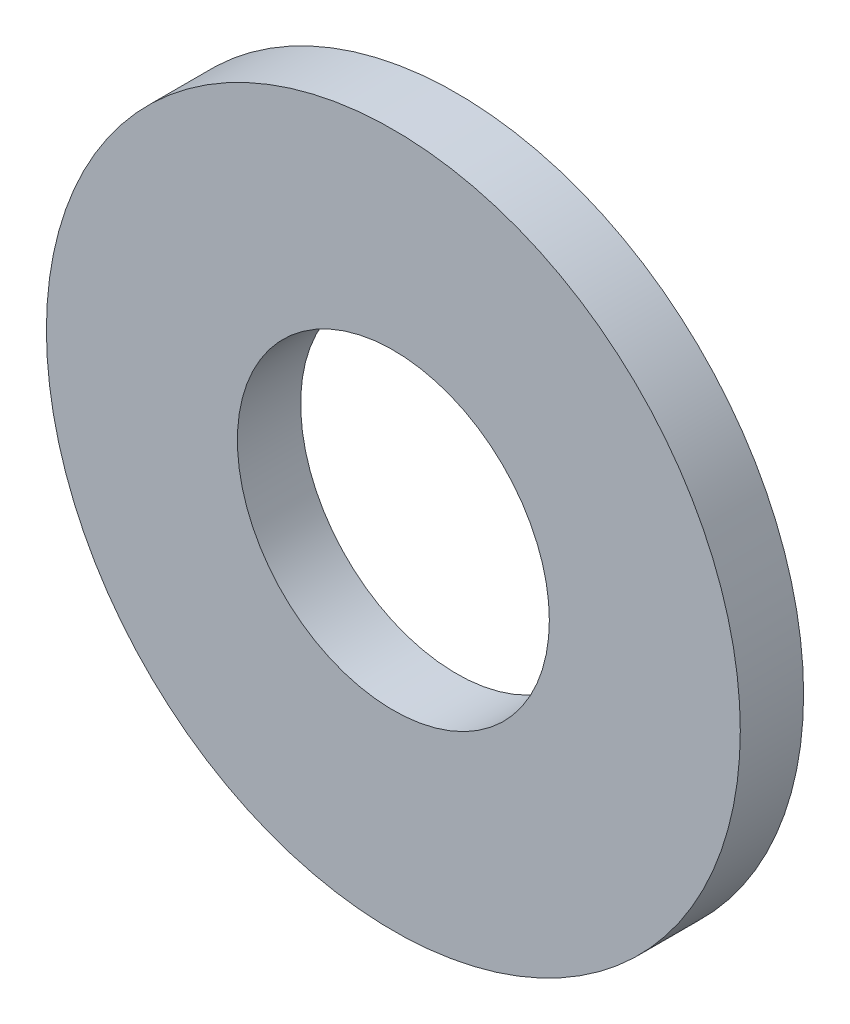
ISO-10303-21;
HEADER;
FILE_DESCRIPTION(('STEP AP214'),'2;1');
FILE_NAME('part.step','',(''),(''),'','','');
FILE_SCHEMA(('AUTOMOTIVE_DESIGN { 1 0 10303 214 1 1 1 1 }'));
ENDSEC;
DATA;
#1=APPLICATION_CONTEXT('core data for automotive mechanical design processes');
#2=APPLICATION_PROTOCOL_DEFINITION('international standard','automotive_design',2000,#1);
#3=PRODUCT_CONTEXT('',#1,'mechanical');
#4=PRODUCT('Part','Part','',(#3));
#5=PRODUCT_RELATED_PRODUCT_CATEGORY('part','',(#4));
#6=PRODUCT_DEFINITION_FORMATION('','',#4);
#7=PRODUCT_DEFINITION_CONTEXT('part definition',#1,'design');
#8=PRODUCT_DEFINITION('design','',#6,#7);
#9=PRODUCT_DEFINITION_SHAPE('','',#8);
#10=(LENGTH_UNIT() NAMED_UNIT(*) SI_UNIT(.MILLI.,.METRE.));
#11=(NAMED_UNIT(*) PLANE_ANGLE_UNIT() SI_UNIT($,.RADIAN.));
#12=(NAMED_UNIT(*) SI_UNIT($,.STERADIAN.) SOLID_ANGLE_UNIT());
#13=UNCERTAINTY_MEASURE_WITH_UNIT(LENGTH_MEASURE(1.E-05),#10,'distance_accuracy_value','');
#14=(GEOMETRIC_REPRESENTATION_CONTEXT(3) GLOBAL_UNCERTAINTY_ASSIGNED_CONTEXT((#13)) GLOBAL_UNIT_ASSIGNED_CONTEXT((#10,
#11,#12)) REPRESENTATION_CONTEXT('',''));
#15=CARTESIAN_POINT('',(0.,0.,0.));
#16=DIRECTION('',(0.,0.,1.));
#17=DIRECTION('',(1.,0.,0.));
#18=AXIS2_PLACEMENT_3D('',#15,#16,#17);
#19=CARTESIAN_POINT('',(0.,0.,0.));
#20=DIRECTION('',(0.,0.,1.));
#21=DIRECTION('',(1.,0.,0.));
#22=AXIS2_PLACEMENT_3D('',#19,#20,#21);
#23=PLANE('',#22);
#24=CARTESIAN_POINT('',(0.,0.,0.));
#25=DIRECTION('',(0.,0.,1.));
#26=DIRECTION('',(1.,0.,0.));
#27=AXIS2_PLACEMENT_3D('',#24,#25,#26);
#28=CIRCLE('',#27,3.5687);
#29=CARTESIAN_POINT('',(3.5687,0.,0.));
#30=VERTEX_POINT('',#29);
#31=EDGE_CURVE('E27',#30,#30,#28,.T.);
#32=ORIENTED_EDGE('',*,*,#31,.T.);
#33=EDGE_LOOP('',(#32));
#34=FACE_BOUND('',#33,.T.);
#35=CARTESIAN_POINT('',(0.,0.,0.));
#36=DIRECTION('',(0.,0.,1.));
#37=DIRECTION('',(1.,0.,0.));
#38=AXIS2_PLACEMENT_3D('',#35,#36,#37);
#39=CIRCLE('',#38,7.9375);
#40=CARTESIAN_POINT('',(7.9375,0.,0.));
#41=VERTEX_POINT('',#40);
#42=EDGE_CURVE('E18',#41,#41,#39,.T.);
#43=ORIENTED_EDGE('',*,*,#42,.F.);
#44=EDGE_LOOP('',(#43));
#45=FACE_BOUND('',#44,.T.);
#46=ADVANCED_FACE('F15',(#34,#45),#23,.F.);
#47=CARTESIAN_POINT('',(0.,0.,0.));
#48=DIRECTION('',(0.,0.,1.));
#49=DIRECTION('',(1.,0.,0.));
#50=AXIS2_PLACEMENT_3D('',#47,#48,#49);
#51=CYLINDRICAL_SURFACE('',#50,7.9375);
#52=ORIENTED_EDGE('',*,*,#42,.T.);
#53=EDGE_LOOP('',(#52));
#54=FACE_BOUND('',#53,.T.);
#55=CARTESIAN_POINT('',(0.,0.,1.4478));
#56=DIRECTION('',(0.,0.,1.));
#57=DIRECTION('',(1.,0.,0.));
#58=AXIS2_PLACEMENT_3D('',#55,#56,#57);
#59=CIRCLE('',#58,7.9375);
#60=CARTESIAN_POINT('',(7.9375,0.,1.4478));
#61=VERTEX_POINT('',#60);
#62=EDGE_CURVE('E22',#61,#61,#59,.T.);
#63=ORIENTED_EDGE('',*,*,#62,.F.);
#64=EDGE_LOOP('',(#63));
#65=FACE_BOUND('',#64,.T.);
#66=ADVANCED_FACE('F35',(#54,#65),#51,.T.);
#67=CARTESIAN_POINT('',(0.,0.,0.));
#68=DIRECTION('',(0.,0.,1.));
#69=DIRECTION('',(1.,0.,0.));
#70=AXIS2_PLACEMENT_3D('',#67,#68,#69);
#71=CYLINDRICAL_SURFACE('',#70,3.5687);
#72=ORIENTED_EDGE('',*,*,#31,.F.);
#73=EDGE_LOOP('',(#72));
#74=FACE_BOUND('',#73,.T.);
#75=CARTESIAN_POINT('',(0.,0.,1.4478));
#76=DIRECTION('',(0.,0.,1.));
#77=DIRECTION('',(1.,0.,0.));
#78=AXIS2_PLACEMENT_3D('',#75,#76,#77);
#79=CIRCLE('',#78,3.5687);
#80=CARTESIAN_POINT('',(3.5687,0.,1.4478));
#81=VERTEX_POINT('',#80);
#82=EDGE_CURVE('E10',#81,#81,#79,.F.);
#83=ORIENTED_EDGE('',*,*,#82,.F.);
#84=EDGE_LOOP('',(#83));
#85=FACE_BOUND('',#84,.T.);
#86=ADVANCED_FACE('F43',(#74,#85),#71,.F.);
#87=CARTESIAN_POINT('',(0.,0.,1.4478));
#88=DIRECTION('',(0.,0.,1.));
#89=DIRECTION('',(1.,0.,0.));
#90=AXIS2_PLACEMENT_3D('',#87,#88,#89);
#91=PLANE('',#90);
#92=ORIENTED_EDGE('',*,*,#82,.T.);
#93=EDGE_LOOP('',(#92));
#94=FACE_BOUND('',#93,.T.);
#95=ORIENTED_EDGE('',*,*,#62,.T.);
#96=EDGE_LOOP('',(#95));
#97=FACE_BOUND('',#96,.T.);
#98=ADVANCED_FACE('F44',(#94,#97),#91,.T.);
#99=CLOSED_SHELL('',(#46,#66,#86,#98));
#100=MANIFOLD_SOLID_BREP('B1',#99);
#101=ADVANCED_BREP_SHAPE_REPRESENTATION('',(#18,#100),#14);
#102=SHAPE_DEFINITION_REPRESENTATION(#9,#101);
ENDSEC;
END-ISO-10303-21;
